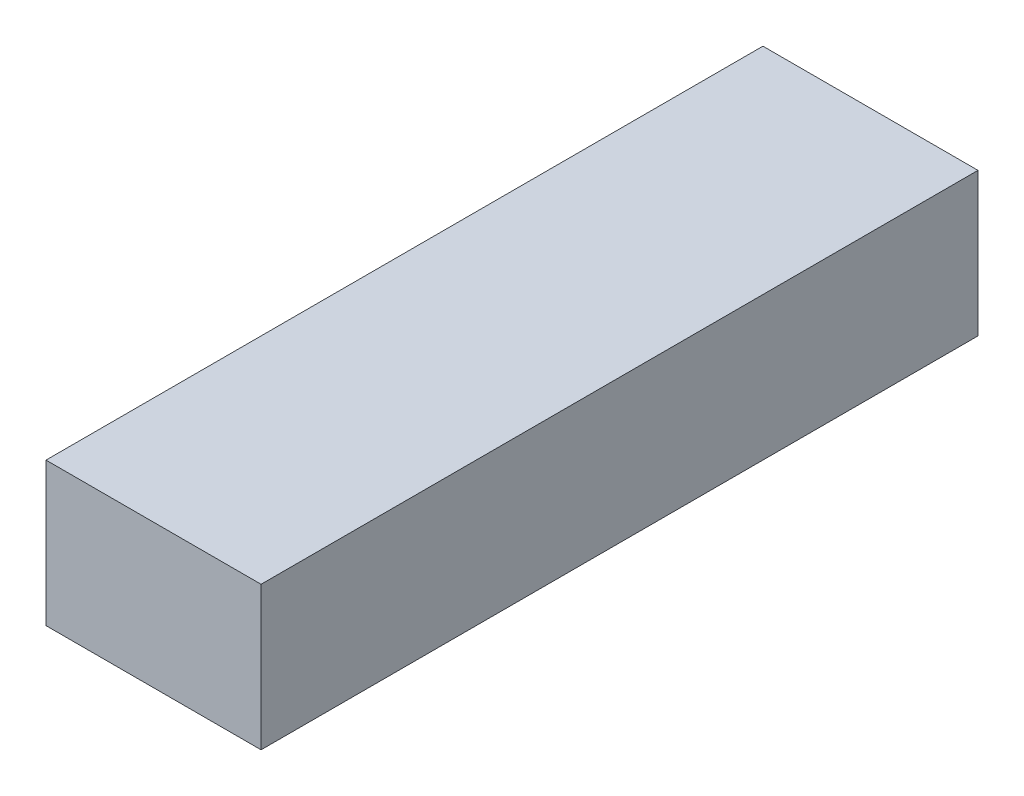
ISO-10303-21;
HEADER;
FILE_DESCRIPTION(('STEP AP214'),'2;1');
FILE_NAME('part.step','',(''),(''),'','','');
FILE_SCHEMA(('AUTOMOTIVE_DESIGN { 1 0 10303 214 1 1 1 1 }'));
ENDSEC;
DATA;
#1=APPLICATION_CONTEXT('core data for automotive mechanical design processes');
#2=APPLICATION_PROTOCOL_DEFINITION('international standard','automotive_design',2000,#1);
#3=PRODUCT_CONTEXT('',#1,'mechanical');
#4=PRODUCT('Part','Part','',(#3));
#5=PRODUCT_RELATED_PRODUCT_CATEGORY('part','',(#4));
#6=PRODUCT_DEFINITION_FORMATION('','',#4);
#7=PRODUCT_DEFINITION_CONTEXT('part definition',#1,'design');
#8=PRODUCT_DEFINITION('design','',#6,#7);
#9=PRODUCT_DEFINITION_SHAPE('','',#8);
#10=(LENGTH_UNIT() NAMED_UNIT(*) SI_UNIT(.MILLI.,.METRE.));
#11=(NAMED_UNIT(*) PLANE_ANGLE_UNIT() SI_UNIT($,.RADIAN.));
#12=(NAMED_UNIT(*) SI_UNIT($,.STERADIAN.) SOLID_ANGLE_UNIT());
#13=UNCERTAINTY_MEASURE_WITH_UNIT(LENGTH_MEASURE(1.E-05),#10,'distance_accuracy_value','');
#14=(GEOMETRIC_REPRESENTATION_CONTEXT(3) GLOBAL_UNCERTAINTY_ASSIGNED_CONTEXT((#13)) GLOBAL_UNIT_ASSIGNED_CONTEXT((#10,
#11,#12)) REPRESENTATION_CONTEXT('',''));
#15=CARTESIAN_POINT('',(0.,0.,0.));
#16=DIRECTION('',(0.,0.,1.));
#17=DIRECTION('',(1.,0.,0.));
#18=AXIS2_PLACEMENT_3D('',#15,#16,#17);
#19=CARTESIAN_POINT('',(6.,0.,0.));
#20=DIRECTION('',(0.,0.,-1.));
#21=DIRECTION('',(-1.,0.,0.));
#22=AXIS2_PLACEMENT_3D('',#19,#20,#21);
#23=PLANE('',#22);
#24=DIRECTION('',(0.,-1.,0.));
#25=VECTOR('',#24,1.);
#26=CARTESIAN_POINT('',(0.,0.,0.));
#27=LINE('',#26,#25);
#28=CARTESIAN_POINT('',(0.,4.,0.));
#29=VERTEX_POINT('',#28);
#30=CARTESIAN_POINT('',(0.,0.,0.));
#31=VERTEX_POINT('',#30);
#32=EDGE_CURVE('E97',#29,#31,#27,.T.);
#33=ORIENTED_EDGE('',*,*,#32,.T.);
#34=DIRECTION('',(-1.,0.,0.));
#35=VECTOR('',#34,1.);
#36=CARTESIAN_POINT('',(6.,0.,0.));
#37=LINE('',#36,#35);
#38=CARTESIAN_POINT('',(6.,0.,0.));
#39=VERTEX_POINT('',#38);
#40=EDGE_CURVE('E11',#39,#31,#37,.T.);
#41=ORIENTED_EDGE('',*,*,#40,.F.);
#42=DIRECTION('',(0.,-1.,0.));
#43=VECTOR('',#42,1.);
#44=CARTESIAN_POINT('',(6.,0.,0.));
#45=LINE('',#44,#43);
#46=CARTESIAN_POINT('',(6.,4.,0.));
#47=VERTEX_POINT('',#46);
#48=EDGE_CURVE('E85',#47,#39,#45,.T.);
#49=ORIENTED_EDGE('',*,*,#48,.F.);
#50=DIRECTION('',(-1.,0.,0.));
#51=VECTOR('',#50,1.);
#52=CARTESIAN_POINT('',(6.,4.,0.));
#53=LINE('',#52,#51);
#54=EDGE_CURVE('E93',#47,#29,#53,.T.);
#55=ORIENTED_EDGE('',*,*,#54,.T.);
#56=EDGE_LOOP('',(#33,#41,#49,#55));
#57=FACE_BOUND('',#56,.T.);
#58=ADVANCED_FACE('F34',(#57),#23,.F.);
#59=CARTESIAN_POINT('',(6.,0.,0.));
#60=DIRECTION('',(0.,1.,0.));
#61=DIRECTION('',(0.,0.,1.));
#62=AXIS2_PLACEMENT_3D('',#59,#60,#61);
#63=PLANE('',#62);
#64=DIRECTION('',(0.,0.,-1.));
#65=VECTOR('',#64,1.);
#66=CARTESIAN_POINT('',(0.,0.,0.));
#67=LINE('',#66,#65);
#68=CARTESIAN_POINT('',(0.,0.,-20.));
#69=VERTEX_POINT('',#68);
#70=EDGE_CURVE('E89',#31,#69,#67,.T.);
#71=ORIENTED_EDGE('',*,*,#70,.T.);
#72=DIRECTION('',(-1.,0.,0.));
#73=VECTOR('',#72,1.);
#74=CARTESIAN_POINT('',(6.,0.,-20.));
#75=LINE('',#74,#73);
#76=CARTESIAN_POINT('',(6.,0.,-20.));
#77=VERTEX_POINT('',#76);
#78=EDGE_CURVE('E42',#77,#69,#75,.T.);
#79=ORIENTED_EDGE('',*,*,#78,.F.);
#80=DIRECTION('',(0.,0.,-1.));
#81=VECTOR('',#80,1.);
#82=CARTESIAN_POINT('',(6.,0.,0.));
#83=LINE('',#82,#81);
#84=EDGE_CURVE('E80',#39,#77,#83,.T.);
#85=ORIENTED_EDGE('',*,*,#84,.F.);
#86=ORIENTED_EDGE('',*,*,#40,.T.);
#87=EDGE_LOOP('',(#71,#79,#85,#86));
#88=FACE_BOUND('',#87,.T.);
#89=ADVANCED_FACE('F88',(#88),#63,.F.);
#90=CARTESIAN_POINT('',(6.,0.,-20.));
#91=DIRECTION('',(0.,0.,1.));
#92=DIRECTION('',(1.,0.,0.));
#93=AXIS2_PLACEMENT_3D('',#90,#91,#92);
#94=PLANE('',#93);
#95=DIRECTION('',(0.,1.,0.));
#96=VECTOR('',#95,1.);
#97=CARTESIAN_POINT('',(0.,0.,-20.));
#98=LINE('',#97,#96);
#99=CARTESIAN_POINT('',(0.,4.,-20.));
#100=VERTEX_POINT('',#99);
#101=EDGE_CURVE('E67',#69,#100,#98,.T.);
#102=ORIENTED_EDGE('',*,*,#101,.T.);
#103=DIRECTION('',(-1.,0.,0.));
#104=VECTOR('',#103,1.);
#105=CARTESIAN_POINT('',(6.,4.,-20.));
#106=LINE('',#105,#104);
#107=CARTESIAN_POINT('',(6.,4.,-20.));
#108=VERTEX_POINT('',#107);
#109=EDGE_CURVE('E90',#108,#100,#106,.T.);
#110=ORIENTED_EDGE('',*,*,#109,.F.);
#111=DIRECTION('',(0.,1.,0.));
#112=VECTOR('',#111,1.);
#113=CARTESIAN_POINT('',(6.,0.,-20.));
#114=LINE('',#113,#112);
#115=EDGE_CURVE('E83',#77,#108,#114,.T.);
#116=ORIENTED_EDGE('',*,*,#115,.F.);
#117=ORIENTED_EDGE('',*,*,#78,.T.);
#118=EDGE_LOOP('',(#102,#110,#116,#117));
#119=FACE_BOUND('',#118,.T.);
#120=ADVANCED_FACE('F91',(#119),#94,.F.);
#121=CARTESIAN_POINT('',(6.,4.,0.));
#122=DIRECTION('',(0.,-1.,0.));
#123=DIRECTION('',(0.,0.,-1.));
#124=AXIS2_PLACEMENT_3D('',#121,#122,#123);
#125=PLANE('',#124);
#126=DIRECTION('',(0.,0.,1.));
#127=VECTOR('',#126,1.);
#128=CARTESIAN_POINT('',(0.,4.,0.));
#129=LINE('',#128,#127);
#130=EDGE_CURVE('E73',#100,#29,#129,.T.);
#131=ORIENTED_EDGE('',*,*,#130,.T.);
#132=ORIENTED_EDGE('',*,*,#54,.F.);
#133=DIRECTION('',(0.,0.,1.));
#134=VECTOR('',#133,1.);
#135=CARTESIAN_POINT('',(6.,4.,0.));
#136=LINE('',#135,#134);
#137=EDGE_CURVE('E50',#108,#47,#136,.T.);
#138=ORIENTED_EDGE('',*,*,#137,.F.);
#139=ORIENTED_EDGE('',*,*,#109,.T.);
#140=EDGE_LOOP('',(#131,#132,#138,#139));
#141=FACE_BOUND('',#140,.T.);
#142=ADVANCED_FACE('F104',(#141),#125,.F.);
#143=CARTESIAN_POINT('',(6.,0.,0.));
#144=DIRECTION('',(-1.,0.,0.));
#145=DIRECTION('',(0.,0.,1.));
#146=AXIS2_PLACEMENT_3D('',#143,#144,#145);
#147=PLANE('',#146);
#148=ORIENTED_EDGE('',*,*,#48,.T.);
#149=ORIENTED_EDGE('',*,*,#84,.T.);
#150=ORIENTED_EDGE('',*,*,#115,.T.);
#151=ORIENTED_EDGE('',*,*,#137,.T.);
#152=EDGE_LOOP('',(#148,#149,#150,#151));
#153=FACE_BOUND('',#152,.T.);
#154=ADVANCED_FACE('F81',(#153),#147,.F.);
#155=CARTESIAN_POINT('',(0.,0.,0.));
#156=DIRECTION('',(-1.,0.,0.));
#157=DIRECTION('',(0.,0.,1.));
#158=AXIS2_PLACEMENT_3D('',#155,#156,#157);
#159=PLANE('',#158);
#160=ORIENTED_EDGE('',*,*,#32,.F.);
#161=ORIENTED_EDGE('',*,*,#130,.F.);
#162=ORIENTED_EDGE('',*,*,#101,.F.);
#163=ORIENTED_EDGE('',*,*,#70,.F.);
#164=EDGE_LOOP('',(#160,#161,#162,#163));
#165=FACE_BOUND('',#164,.T.);
#166=ADVANCED_FACE('F107',(#165),#159,.T.);
#167=CLOSED_SHELL('',(#58,#89,#120,#142,#154,#166));
#168=MANIFOLD_SOLID_BREP('B2',#167);
#169=ADVANCED_BREP_SHAPE_REPRESENTATION('',(#18,#168),#14);
#170=SHAPE_DEFINITION_REPRESENTATION(#9,#169);
ENDSEC;
END-ISO-10303-21;
